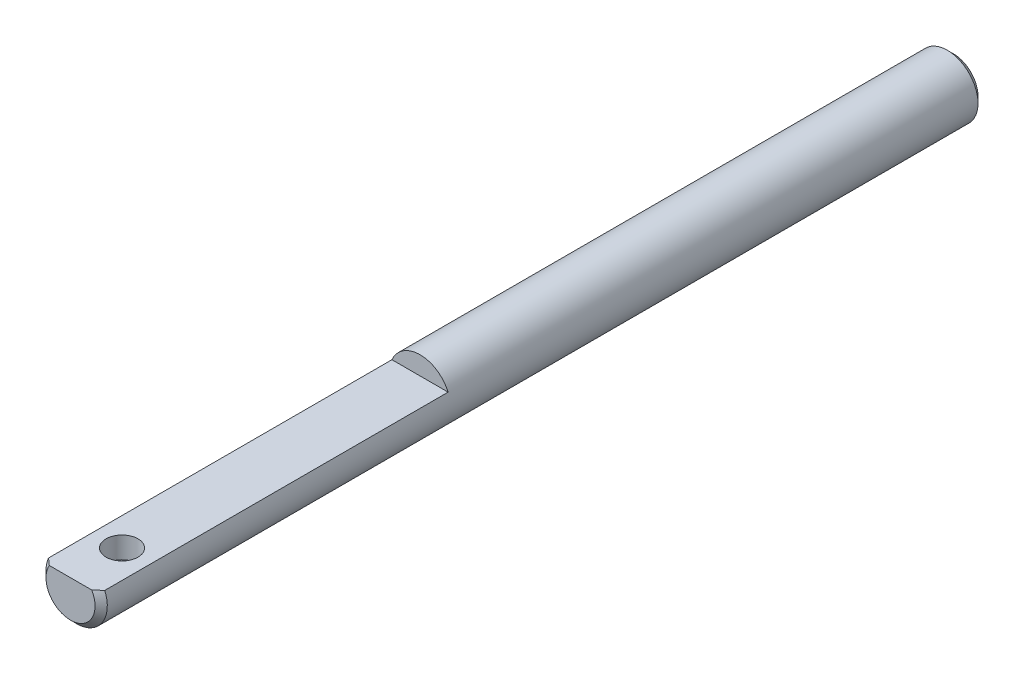
ISO-10303-21;
HEADER;
FILE_DESCRIPTION(('STEP AP214'),'2;1');
FILE_NAME('part.step','',(''),(''),'','','');
FILE_SCHEMA(('AUTOMOTIVE_DESIGN { 1 0 10303 214 1 1 1 1 }'));
ENDSEC;
DATA;
#1=APPLICATION_CONTEXT('core data for automotive mechanical design processes');
#2=APPLICATION_PROTOCOL_DEFINITION('international standard','automotive_design',2000,#1);
#3=PRODUCT_CONTEXT('',#1,'mechanical');
#4=PRODUCT('Part','Part','',(#3));
#5=PRODUCT_RELATED_PRODUCT_CATEGORY('part','',(#4));
#6=PRODUCT_DEFINITION_FORMATION('','',#4);
#7=PRODUCT_DEFINITION_CONTEXT('part definition',#1,'design');
#8=PRODUCT_DEFINITION('design','',#6,#7);
#9=PRODUCT_DEFINITION_SHAPE('','',#8);
#10=(LENGTH_UNIT() NAMED_UNIT(*) SI_UNIT(.MILLI.,.METRE.));
#11=(NAMED_UNIT(*) PLANE_ANGLE_UNIT() SI_UNIT($,.RADIAN.));
#12=(NAMED_UNIT(*) SI_UNIT($,.STERADIAN.) SOLID_ANGLE_UNIT());
#13=UNCERTAINTY_MEASURE_WITH_UNIT(LENGTH_MEASURE(1.E-05),#10,'distance_accuracy_value','');
#14=(GEOMETRIC_REPRESENTATION_CONTEXT(3) GLOBAL_UNCERTAINTY_ASSIGNED_CONTEXT((#13)) GLOBAL_UNIT_ASSIGNED_CONTEXT((#10,
#11,#12)) REPRESENTATION_CONTEXT('',''));
#15=CARTESIAN_POINT('',(0.,0.,0.));
#16=DIRECTION('',(0.,0.,1.));
#17=DIRECTION('',(1.,0.,0.));
#18=AXIS2_PLACEMENT_3D('',#15,#16,#17);
#19=CARTESIAN_POINT('',(0.,0.,45.72));
#20=DIRECTION('',(0.,0.,-1.));
#21=DIRECTION('',(-1.,0.,0.));
#22=AXIS2_PLACEMENT_3D('',#19,#20,#21);
#23=CYLINDRICAL_SURFACE('',#22,3.175);
#24=CARTESIAN_POINT('',(0.,0.,-45.085));
#25=DIRECTION('',(0.,0.,1.));
#26=DIRECTION('',(1.,0.,0.));
#27=AXIS2_PLACEMENT_3D('',#24,#25,#26);
#28=CIRCLE('',#27,3.175);
#29=CARTESIAN_POINT('',(3.175,0.,-45.085));
#30=VERTEX_POINT('',#29);
#31=EDGE_CURVE('E98',#30,#30,#28,.T.);
#32=ORIENTED_EDGE('',*,*,#31,.T.);
#33=EDGE_LOOP('',(#32));
#34=FACE_BOUND('',#33,.T.);
#35=DIRECTION('',(0.,0.,-1.));
#36=VECTOR('',#35,1.);
#37=CARTESIAN_POINT('',(2.90993556629696,1.27,45.72));
#38=LINE('',#37,#36);
#39=CARTESIAN_POINT('',(2.90993556629696,1.27,45.085));
#40=VERTEX_POINT('',#39);
#41=CARTESIAN_POINT('',(2.90993556629696,1.27,9.525));
#42=VERTEX_POINT('',#41);
#43=EDGE_CURVE('E79',#40,#42,#38,.T.);
#44=ORIENTED_EDGE('',*,*,#43,.F.);
#45=CARTESIAN_POINT('',(0.,0.,45.085));
#46=DIRECTION('',(0.,0.,1.));
#47=DIRECTION('',(1.,0.,0.));
#48=AXIS2_PLACEMENT_3D('',#45,#46,#47);
#49=CIRCLE('',#48,3.175);
#50=CARTESIAN_POINT('',(-2.90993556629696,1.27,45.085));
#51=VERTEX_POINT('',#50);
#52=EDGE_CURVE('E93',#40,#51,#49,.F.);
#53=ORIENTED_EDGE('',*,*,#52,.T.);
#54=DIRECTION('',(0.,0.,-1.));
#55=VECTOR('',#54,1.);
#56=CARTESIAN_POINT('',(-2.90993556629696,1.27,45.72));
#57=LINE('',#56,#55);
#58=CARTESIAN_POINT('',(-2.90993556629696,1.27,9.525));
#59=VERTEX_POINT('',#58);
#60=EDGE_CURVE('E61',#51,#59,#57,.T.);
#61=ORIENTED_EDGE('',*,*,#60,.T.);
#62=CARTESIAN_POINT('',(0.,0.,9.525));
#63=DIRECTION('',(0.,0.,1.));
#64=DIRECTION('',(1.,0.,0.));
#65=AXIS2_PLACEMENT_3D('',#62,#63,#64);
#66=CIRCLE('',#65,3.175);
#67=EDGE_CURVE('E84',#42,#59,#66,.T.);
#68=ORIENTED_EDGE('',*,*,#67,.F.);
#69=EDGE_LOOP('',(#44,#53,#61,#68));
#70=FACE_BOUND('',#69,.T.);
#71=ADVANCED_FACE('F39',(#34,#70),#23,.T.);
#72=CARTESIAN_POINT('',(0.,0.,45.72));
#73=DIRECTION('',(0.,0.,1.));
#74=DIRECTION('',(1.,0.,0.));
#75=AXIS2_PLACEMENT_3D('',#72,#73,#74);
#76=PLANE('',#75);
#77=CARTESIAN_POINT('',(0.,0.,45.72));
#78=DIRECTION('',(0.,0.,1.));
#79=DIRECTION('',(1.,0.,0.));
#80=AXIS2_PLACEMENT_3D('',#77,#78,#79);
#81=CIRCLE('',#80,2.54000000000001);
#82=CARTESIAN_POINT('',(-2.19970452561249,1.27,45.72));
#83=VERTEX_POINT('',#82);
#84=CARTESIAN_POINT('',(2.19970452561249,1.27,45.72));
#85=VERTEX_POINT('',#84);
#86=EDGE_CURVE('E108',#83,#85,#81,.T.);
#87=ORIENTED_EDGE('',*,*,#86,.T.);
#88=DIRECTION('',(1.,0.,0.));
#89=VECTOR('',#88,1.);
#90=CARTESIAN_POINT('',(-2.90993556629696,1.27,45.72));
#91=LINE('',#90,#89);
#92=EDGE_CURVE('E83',#83,#85,#91,.T.);
#93=ORIENTED_EDGE('',*,*,#92,.F.);
#94=EDGE_LOOP('',(#87,#93));
#95=FACE_BOUND('',#94,.T.);
#96=ADVANCED_FACE('F116',(#95),#76,.T.);
#97=CARTESIAN_POINT('',(0.,0.,45.72));
#98=DIRECTION('',(0.,0.,-1.));
#99=DIRECTION('',(-1.,0.,0.));
#100=AXIS2_PLACEMENT_3D('',#97,#98,#99);
#101=CONICAL_SURFACE('',#100,2.54000000000001,0.78539816339744);
#102=ORIENTED_EDGE('',*,*,#52,.F.);
#103=CARTESIAN_POINT('',(6.42278200452555,1.27,41.7128610311329));
#104=CARTESIAN_POINT('',(6.26210721168731,1.27,41.8704763991302));
#105=CARTESIAN_POINT('',(6.1013282227042,1.27,42.0279858199212));
#106=CARTESIAN_POINT('',(5.7792561069319,1.27,42.3429449204624));
#107=CARTESIAN_POINT('',(5.61796257279019,1.27,42.5003941835959));
#108=CARTESIAN_POINT('',(5.29104462756841,1.27,42.8188005998857));
#109=CARTESIAN_POINT('',(5.12541136599066,1.27,42.9797486702902));
#110=CARTESIAN_POINT('',(4.79389464734629,1.27,43.3009040947186));
#111=CARTESIAN_POINT('',(4.62801190454432,1.27,43.4611121855974));
#112=CARTESIAN_POINT('',(4.31132195915219,1.27,43.7657036733442));
#113=CARTESIAN_POINT('',(4.16057449675533,1.27,43.9101491369294));
#114=CARTESIAN_POINT('',(3.85831941184804,1.27,44.1982957443235));
#115=CARTESIAN_POINT('',(3.70681166222861,1.27,44.3419967549151));
#116=CARTESIAN_POINT('',(3.40189254577467,1.27,44.6291440405994));
#117=CARTESIAN_POINT('',(3.24847523581961,1.27,44.7725840189696));
#118=CARTESIAN_POINT('',(2.9402366906097,1.27,45.0577407047047));
#119=CARTESIAN_POINT('',(2.78541646923709,1.27,45.1994585064386));
#120=CARTESIAN_POINT('',(2.47705839924348,1.27,45.4771484375006));
#121=CARTESIAN_POINT('',(2.32357251988308,1.27,45.6131778056492));
#122=CARTESIAN_POINT('',(2.09046039037859,1.27,45.8143086330409));
#123=CARTESIAN_POINT('',(2.01216885502039,1.27,45.8809541188027));
#124=CARTESIAN_POINT('',(1.8544066846146,1.27,46.0128156224585));
#125=CARTESIAN_POINT('',(1.7749362332802,1.27,46.0780318592322));
#126=CARTESIAN_POINT('',(1.61532218164291,1.27,46.2057608877443));
#127=CARTESIAN_POINT('',(1.53519650907127,1.27,46.268295986864));
#128=CARTESIAN_POINT('',(1.37277349960251,1.27,46.3906303855736));
#129=CARTESIAN_POINT('',(1.2904747058388,1.27,46.4504277723903));
#130=CARTESIAN_POINT('',(1.12334663165449,1.27,46.5655554624641));
#131=CARTESIAN_POINT('',(1.03853070271589,1.27,46.6209050129997));
#132=CARTESIAN_POINT('',(0.864967162781311,1.27,46.7249960334207));
#133=CARTESIAN_POINT('',(0.776226436641137,1.27,46.7737485099411));
#134=CARTESIAN_POINT('',(0.665498878696809,1.27,46.8262978656154));
#135=CARTESIAN_POINT('',(0.645959248496781,1.27,46.8352706322055));
#136=CARTESIAN_POINT('',(0.606628072964542,1.27,46.8526673996433));
#137=CARTESIAN_POINT('',(0.586836440890597,1.27,46.8610912050745));
#138=CARTESIAN_POINT('',(0.547004833575202,1.27,46.8773272240186));
#139=CARTESIAN_POINT('',(0.526964879006455,1.27,46.885139488051));
#140=CARTESIAN_POINT('',(0.486635882194837,1.27,46.9000869376276));
#141=CARTESIAN_POINT('',(0.466346851341436,1.27,46.9072221540017));
#142=CARTESIAN_POINT('',(0.405715292760378,1.27,46.9273087625773));
#143=CARTESIAN_POINT('',(0.365008330649114,1.27,46.9391893560189));
#144=CARTESIAN_POINT('',(0.282724640636789,1.27,46.9595212672701));
#145=CARTESIAN_POINT('',(0.241147662520578,1.27,46.9679715838785));
#146=CARTESIAN_POINT('',(0.156465117651901,1.27,46.9810956630494));
#147=CARTESIAN_POINT('',(0.113345950990248,1.27,46.9856836116455));
#148=CARTESIAN_POINT('',(0.0268757755816794,1.27,46.9904488344772));
#149=CARTESIAN_POINT('',(-0.0164751431717171,1.27,46.9906277117465));
#150=CARTESIAN_POINT('',(-0.103004027670614,1.27,46.9865637485233));
#151=CARTESIAN_POINT('',(-0.146181805605785,1.27,46.9823169806269));
#152=CARTESIAN_POINT('',(-0.231932023538957,1.27,46.9696935206565));
#153=CARTESIAN_POINT('',(-0.274504227194805,1.27,46.9613152593146));
#154=CARTESIAN_POINT('',(-0.370133377748524,1.27,46.9381818024125));
#155=CARTESIAN_POINT('',(-0.422919408411027,1.27,46.9223158644999));
#156=CARTESIAN_POINT('',(-0.526844433361235,1.27,46.8859224667411));
#157=CARTESIAN_POINT('',(-0.577982652417746,1.27,46.8653928483464));
#158=CARTESIAN_POINT('',(-0.678990426768542,1.27,46.8206027017818));
#159=CARTESIAN_POINT('',(-0.72884904487553,1.27,46.7963178483254));
#160=CARTESIAN_POINT('',(-0.827094785912547,1.27,46.744997678473));
#161=CARTESIAN_POINT('',(-0.875482323800739,1.27,46.7179631472261));
#162=CARTESIAN_POINT('',(-0.973774829801042,1.27,46.6601668828299));
#163=CARTESIAN_POINT('',(-1.02360567894397,1.27,46.6292800101983));
#164=CARTESIAN_POINT('',(-1.12211152901177,1.27,46.5657083600644));
#165=CARTESIAN_POINT('',(-1.17078631160588,1.27,46.5330232467578));
#166=CARTESIAN_POINT('',(-1.31545365961255,1.27,46.4328607074291));
#167=CARTESIAN_POINT('',(-1.41001485852402,1.27,46.3633215391634));
#168=CARTESIAN_POINT('',(-1.59673799013279,1.27,46.2206699704812));
#169=CARTESIAN_POINT('',(-1.68889324270325,1.27,46.1475489696327));
#170=CARTESIAN_POINT('',(-1.87135009521773,1.27,45.9990161537972));
#171=CARTESIAN_POINT('',(-1.96165147558291,1.27,45.92360407004));
#172=CARTESIAN_POINT('',(-2.14128180932055,1.27,45.7708740368029));
#173=CARTESIAN_POINT('',(-2.23060501890264,1.27,45.6935493641495));
#174=CARTESIAN_POINT('',(-2.40824298973188,1.27,45.5377352106348));
#175=CARTESIAN_POINT('',(-2.49655764944166,1.27,45.4592456142907));
#176=CARTESIAN_POINT('',(-2.7600512182412,1.27,45.2227767270556));
#177=CARTESIAN_POINT('',(-2.93409039813152,1.27,45.0635291703269));
#178=CARTESIAN_POINT('',(-3.24918681468567,1.27,44.7718353334846));
#179=CARTESIAN_POINT('',(-3.39054938234102,1.27,44.6397167776658));
#180=CARTESIAN_POINT('',(-3.67237478658402,1.27,44.3745189164403));
#181=CARTESIAN_POINT('',(-3.81283760849061,1.27,44.2414395954319));
#182=CARTESIAN_POINT('',(-4.23344284588025,1.27,43.8410066043371));
#183=CARTESIAN_POINT('',(-4.51261371424532,1.27,43.5726337466561));
#184=CARTESIAN_POINT('',(-5.06421068310113,1.27,43.0394320535144));
#185=CARTESIAN_POINT('',(-5.33666462992704,1.27,42.7746319404337));
#186=CARTESIAN_POINT('',(-5.74454810118163,1.27,42.3768170075628));
#187=CARTESIAN_POINT('',(-5.88032592836004,1.27,42.2441590917347));
#188=CARTESIAN_POINT('',(-6.15168867960237,1.27,41.9786471012981));
#189=CARTESIAN_POINT('',(-6.28727360438551,1.27,41.8457930274247));
#190=CARTESIAN_POINT('',(-6.42278200452555,1.27,41.7128610311329));
#191=B_SPLINE_CURVE_WITH_KNOTS('',3,(#103,#104,#105,#106,#107,#108,#109,#110,#111,#112,#113,
#114,#115,#116,#117,#118,#119,#120,#121,#122,#123,#124,#125,#126,#127,#128,#129,#130,#131,#132,
#133,#134,#135,#136,#137,#138,#139,#140,#141,#142,#143,#144,#145,#146,#147,#148,#149,#150,#151,
#152,#153,#154,#155,#156,#157,#158,#159,#160,#161,#162,#163,#164,#165,#166,#167,#168,#169,#170,
#171,#172,#173,#174,#175,#176,#177,#178,#179,#180,#181,#182,#183,#184,#185,#186,#187,#188,#189,
#190),.UNSPECIFIED.,.F.,.F.,(4,2,2,2,2,2,2,2,2,2,2,2,2,2,2,2,2,2,2,2,2,2,2,2,2,2,2,2,2,2,2,2,2,
2,2,2,2,2,2,2,2,2,2,4),(0.,0.675226819903113,1.35143118632974,2.04428529947978,2.73613170695817,
3.36247116300148,3.98891907576647,4.61899554413758,5.24864814579979,5.86386585139154,
6.1723031102035,6.4806927991616,6.78557605584231,7.09066917404058,7.39436166702051,
7.69754105860944,7.76203821505556,7.82655820685507,7.89107286301455,7.95558458003088,
8.08266433635906,8.20978115707231,8.33965284063259,8.46947730523211,8.59941707678428,
8.72940624150817,8.8944746258567,9.05961956706263,9.22588292019623,9.39209893069552,
9.56792921295322,9.74379244203678,10.0957799245778,10.4486585110923,10.8015786553638,
11.1559946323492,11.5104459816175,12.2181177013525,12.7985864694192,13.3790646849382,
14.5407940253703,15.6805950586603,16.2500715335548,16.8195458795695),.UNSPECIFIED.);
#192=EDGE_CURVE('E11',#40,#85,#191,.T.);
#193=ORIENTED_EDGE('',*,*,#192,.T.);
#194=ORIENTED_EDGE('',*,*,#86,.F.);
#195=EDGE_CURVE('E44',#83,#51,#191,.T.);
#196=ORIENTED_EDGE('',*,*,#195,.T.);
#197=EDGE_LOOP('',(#102,#193,#194,#196));
#198=FACE_BOUND('',#197,.T.);
#199=ADVANCED_FACE('F41',(#198),#101,.T.);
#200=CARTESIAN_POINT('',(0.,0.,-45.72));
#201=DIRECTION('',(0.,0.,1.));
#202=DIRECTION('',(1.,0.,0.));
#203=AXIS2_PLACEMENT_3D('',#200,#201,#202);
#204=PLANE('',#203);
#205=CARTESIAN_POINT('',(0.,0.,-45.72));
#206=DIRECTION('',(0.,0.,1.));
#207=DIRECTION('',(1.,0.,0.));
#208=AXIS2_PLACEMENT_3D('',#205,#206,#207);
#209=CIRCLE('',#208,2.54000000000001);
#210=CARTESIAN_POINT('',(2.54000000000001,0.,-45.72));
#211=VERTEX_POINT('',#210);
#212=EDGE_CURVE('E105',#211,#211,#209,.F.);
#213=ORIENTED_EDGE('',*,*,#212,.T.);
#214=EDGE_LOOP('',(#213));
#215=FACE_BOUND('',#214,.T.);
#216=ADVANCED_FACE('F143',(#215),#204,.F.);
#217=CARTESIAN_POINT('',(0.,0.,-45.085));
#218=DIRECTION('',(0.,0.,1.));
#219=DIRECTION('',(1.,0.,0.));
#220=AXIS2_PLACEMENT_3D('',#217,#218,#219);
#221=CONICAL_SURFACE('',#220,3.175,0.785398163397446);
#222=ORIENTED_EDGE('',*,*,#212,.F.);
#223=EDGE_LOOP('',(#222));
#224=FACE_BOUND('',#223,.T.);
#225=ORIENTED_EDGE('',*,*,#31,.F.);
#226=EDGE_LOOP('',(#225));
#227=FACE_BOUND('',#226,.T.);
#228=ADVANCED_FACE('F137',(#224,#227),#221,.T.);
#229=CARTESIAN_POINT('',(-2.90993556629696,1.27,45.72));
#230=DIRECTION('',(0.,1.,0.));
#231=DIRECTION('',(0.,0.,1.));
#232=AXIS2_PLACEMENT_3D('',#229,#230,#231);
#233=PLANE('',#232);
#234=CARTESIAN_POINT('',(0.,1.27,40.386));
#235=DIRECTION('',(0.,1.,0.));
#236=DIRECTION('',(0.,0.,1.));
#237=AXIS2_PLACEMENT_3D('',#234,#235,#236);
#238=CIRCLE('',#237,1.651);
#239=CARTESIAN_POINT('',(0.,1.27,42.037));
#240=VERTEX_POINT('',#239);
#241=EDGE_CURVE('E120',#240,#240,#238,.T.);
#242=ORIENTED_EDGE('',*,*,#241,.F.);
#243=EDGE_LOOP('',(#242));
#244=FACE_BOUND('',#243,.T.);
#245=ORIENTED_EDGE('',*,*,#43,.T.);
#246=DIRECTION('',(1.,0.,0.));
#247=VECTOR('',#246,1.);
#248=CARTESIAN_POINT('',(-2.90993556629696,1.27,9.525));
#249=LINE('',#248,#247);
#250=EDGE_CURVE('E76',#59,#42,#249,.T.);
#251=ORIENTED_EDGE('',*,*,#250,.F.);
#252=ORIENTED_EDGE('',*,*,#60,.F.);
#253=ORIENTED_EDGE('',*,*,#195,.F.);
#254=ORIENTED_EDGE('',*,*,#92,.T.);
#255=ORIENTED_EDGE('',*,*,#192,.F.);
#256=EDGE_LOOP('',(#245,#251,#252,#253,#254,#255));
#257=FACE_BOUND('',#256,.T.);
#258=ADVANCED_FACE('F78',(#244,#257),#233,.T.);
#259=CARTESIAN_POINT('',(0.,0.,9.525));
#260=DIRECTION('',(0.,0.,1.));
#261=DIRECTION('',(1.,0.,0.));
#262=AXIS2_PLACEMENT_3D('',#259,#260,#261);
#263=PLANE('',#262);
#264=ORIENTED_EDGE('',*,*,#67,.T.);
#265=ORIENTED_EDGE('',*,*,#250,.T.);
#266=EDGE_LOOP('',(#264,#265));
#267=FACE_BOUND('',#266,.T.);
#268=ADVANCED_FACE('F86',(#267),#263,.T.);
#269=CARTESIAN_POINT('',(0.,-0.9525,40.386));
#270=DIRECTION('',(0.,1.,0.));
#271=DIRECTION('',(0.,0.,1.));
#272=AXIS2_PLACEMENT_3D('',#269,#270,#271);
#273=CYLINDRICAL_SURFACE('',#272,1.651);
#274=CARTESIAN_POINT('',(0.,-0.9525,40.386));
#275=DIRECTION('',(0.,1.,0.));
#276=DIRECTION('',(0.,0.,1.));
#277=AXIS2_PLACEMENT_3D('',#274,#275,#276);
#278=CIRCLE('',#277,1.651);
#279=CARTESIAN_POINT('',(0.,-0.9525,42.037));
#280=VERTEX_POINT('',#279);
#281=EDGE_CURVE('E89',#280,#280,#278,.T.);
#282=ORIENTED_EDGE('',*,*,#281,.F.);
#283=EDGE_LOOP('',(#282));
#284=FACE_BOUND('',#283,.T.);
#285=ORIENTED_EDGE('',*,*,#241,.T.);
#286=EDGE_LOOP('',(#285));
#287=FACE_BOUND('',#286,.T.);
#288=ADVANCED_FACE('F130',(#284,#287),#273,.F.);
#289=CARTESIAN_POINT('',(0.,-0.9525,40.386));
#290=DIRECTION('',(0.,1.,0.));
#291=DIRECTION('',(0.,0.,1.));
#292=AXIS2_PLACEMENT_3D('',#289,#290,#291);
#293=PLANE('',#292);
#294=ORIENTED_EDGE('',*,*,#281,.T.);
#295=EDGE_LOOP('',(#294));
#296=FACE_BOUND('',#295,.T.);
#297=ADVANCED_FACE('F128',(#296),#293,.T.);
#298=CLOSED_SHELL('',(#71,#96,#199,#216,#228,#258,#268,#288,#297));
#299=MANIFOLD_SOLID_BREP('B2',#298);
#300=ADVANCED_BREP_SHAPE_REPRESENTATION('',(#18,#299),#14);
#301=SHAPE_DEFINITION_REPRESENTATION(#9,#300);
ENDSEC;
END-ISO-10303-21;
